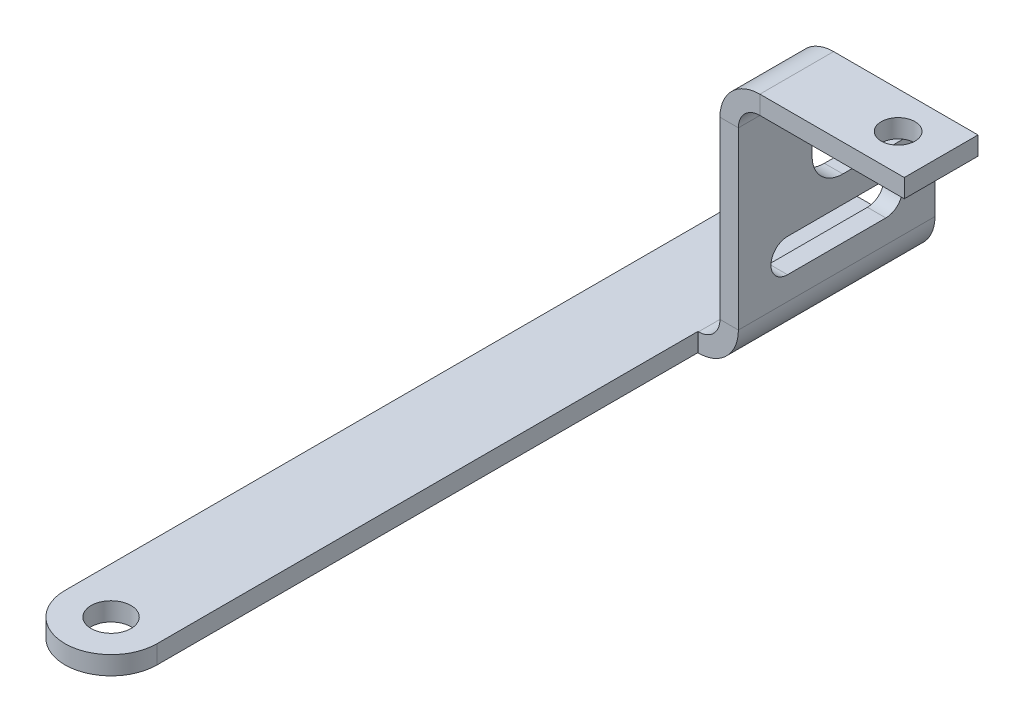
ISO-10303-21;
HEADER;
FILE_DESCRIPTION(('STEP AP214'),'2;1');
FILE_NAME('part.step','',(''),(''),'','','');
FILE_SCHEMA(('AUTOMOTIVE_DESIGN { 1 0 10303 214 1 1 1 1 }'));
ENDSEC;
DATA;
#1=APPLICATION_CONTEXT('core data for automotive mechanical design processes');
#2=APPLICATION_PROTOCOL_DEFINITION('international standard','automotive_design',2000,#1);
#3=PRODUCT_CONTEXT('',#1,'mechanical');
#4=PRODUCT('Part','Part','',(#3));
#5=PRODUCT_RELATED_PRODUCT_CATEGORY('part','',(#4));
#6=PRODUCT_DEFINITION_FORMATION('','',#4);
#7=PRODUCT_DEFINITION_CONTEXT('part definition',#1,'design');
#8=PRODUCT_DEFINITION('design','',#6,#7);
#9=PRODUCT_DEFINITION_SHAPE('','',#8);
#10=(LENGTH_UNIT() NAMED_UNIT(*) SI_UNIT(.MILLI.,.METRE.));
#11=(NAMED_UNIT(*) PLANE_ANGLE_UNIT() SI_UNIT($,.RADIAN.));
#12=(NAMED_UNIT(*) SI_UNIT($,.STERADIAN.) SOLID_ANGLE_UNIT());
#13=UNCERTAINTY_MEASURE_WITH_UNIT(LENGTH_MEASURE(1.E-05),#10,'distance_accuracy_value','');
#14=(GEOMETRIC_REPRESENTATION_CONTEXT(3) GLOBAL_UNCERTAINTY_ASSIGNED_CONTEXT((#13)) GLOBAL_UNIT_ASSIGNED_CONTEXT((#10,
#11,#12)) REPRESENTATION_CONTEXT('',''));
#15=CARTESIAN_POINT('',(0.,0.,0.));
#16=DIRECTION('',(0.,0.,1.));
#17=DIRECTION('',(1.,0.,0.));
#18=AXIS2_PLACEMENT_3D('',#15,#16,#17);
#19=CARTESIAN_POINT('',(14.1,20.,-88.));
#20=DIRECTION('',(0.,-1.,0.));
#21=DIRECTION('',(1.,0.,0.));
#22=AXIS2_PLACEMENT_3D('',#19,#20,#21);
#23=PLANE('',#22);
#24=DIRECTION('',(0.,0.,-1.));
#25=VECTOR('',#24,1.);
#26=CARTESIAN_POINT('',(11.1,20.,-88.));
#27=LINE('',#26,#25);
#28=CARTESIAN_POINT('',(11.1,20.,-115.));
#29=VERTEX_POINT('',#28);
#30=CARTESIAN_POINT('',(11.1,20.,-105.));
#31=VERTEX_POINT('',#30);
#32=EDGE_CURVE('E340',#29,#31,#27,.F.);
#33=ORIENTED_EDGE('',*,*,#32,.T.);
#34=DIRECTION('',(-1.,0.,0.));
#35=VECTOR('',#34,1.);
#36=CARTESIAN_POINT('',(14.1,20.,-105.));
#37=LINE('',#36,#35);
#38=CARTESIAN_POINT('',(14.1,20.,-105.));
#39=VERTEX_POINT('',#38);
#40=EDGE_CURVE('E425',#31,#39,#37,.F.);
#41=ORIENTED_EDGE('',*,*,#40,.T.);
#42=DIRECTION('',(0.,0.,1.));
#43=VECTOR('',#42,1.);
#44=CARTESIAN_POINT('',(14.1000000000001,20.,0.));
#45=LINE('',#44,#43);
#46=CARTESIAN_POINT('',(14.1,20.,-115.));
#47=VERTEX_POINT('',#46);
#48=EDGE_CURVE('E332',#47,#39,#45,.T.);
#49=ORIENTED_EDGE('',*,*,#48,.F.);
#50=DIRECTION('',(-1.,0.,0.));
#51=VECTOR('',#50,1.);
#52=CARTESIAN_POINT('',(14.1,20.,-115.));
#53=LINE('',#52,#51);
#54=EDGE_CURVE('E422',#47,#29,#53,.T.);
#55=ORIENTED_EDGE('',*,*,#54,.T.);
#56=EDGE_LOOP('',(#33,#41,#49,#55));
#57=FACE_BOUND('',#56,.T.);
#58=ADVANCED_FACE('F75',(#57),#23,.F.);
#59=CARTESIAN_POINT('',(7.5,3.,-88.));
#60=DIRECTION('',(0.,0.,1.));
#61=DIRECTION('',(1.,0.,0.));
#62=AXIS2_PLACEMENT_3D('',#59,#60,#61);
#63=PLANE('',#62);
#64=DIRECTION('',(0.,1.,0.));
#65=VECTOR('',#64,1.);
#66=CARTESIAN_POINT('',(7.5,3.,-88.));
#67=LINE('',#66,#65);
#68=CARTESIAN_POINT('',(7.5,0.,-88.));
#69=VERTEX_POINT('',#68);
#70=CARTESIAN_POINT('',(7.5,3.,-88.));
#71=VERTEX_POINT('',#70);
#72=EDGE_CURVE('E416',#69,#71,#67,.T.);
#73=ORIENTED_EDGE('',*,*,#72,.F.);
#74=DIRECTION('',(1.,0.,0.));
#75=VECTOR('',#74,1.);
#76=CARTESIAN_POINT('',(0.,0.,-88.));
#77=LINE('',#76,#75);
#78=CARTESIAN_POINT('',(7.59999999999999,0.,-88.));
#79=VERTEX_POINT('',#78);
#80=EDGE_CURVE('E400',#69,#79,#77,.T.);
#81=ORIENTED_EDGE('',*,*,#80,.T.);
#82=DIRECTION('',(0.,1.,0.));
#83=VECTOR('',#82,1.);
#84=CARTESIAN_POINT('',(7.59999999999999,3.,-88.));
#85=LINE('',#84,#83);
#86=CARTESIAN_POINT('',(7.59999999999999,3.,-88.));
#87=VERTEX_POINT('',#86);
#88=EDGE_CURVE('E414',#79,#87,#85,.T.);
#89=ORIENTED_EDGE('',*,*,#88,.T.);
#90=DIRECTION('',(1.,0.,0.));
#91=VECTOR('',#90,1.);
#92=CARTESIAN_POINT('',(7.5,3.,-88.));
#93=LINE('',#92,#91);
#94=EDGE_CURVE('E373',#71,#87,#93,.T.);
#95=ORIENTED_EDGE('',*,*,#94,.F.);
#96=EDGE_LOOP('',(#73,#81,#89,#95));
#97=FACE_BOUND('',#96,.T.);
#98=ADVANCED_FACE('F508',(#97),#63,.T.);
#99=CARTESIAN_POINT('',(-7.5,3.,-120.));
#100=DIRECTION('',(0.,0.,-1.));
#101=DIRECTION('',(-1.,0.,0.));
#102=AXIS2_PLACEMENT_3D('',#99,#100,#101);
#103=PLANE('',#102);
#104=DIRECTION('',(0.,1.,0.));
#105=VECTOR('',#104,1.);
#106=CARTESIAN_POINT('',(7.59999999999999,3.,-120.));
#107=LINE('',#106,#105);
#108=CARTESIAN_POINT('',(7.59999999999999,0.,-120.));
#109=VERTEX_POINT('',#108);
#110=CARTESIAN_POINT('',(7.59999999999999,3.,-120.));
#111=VERTEX_POINT('',#110);
#112=EDGE_CURVE('E411',#109,#111,#107,.T.);
#113=ORIENTED_EDGE('',*,*,#112,.F.);
#114=DIRECTION('',(1.,0.,0.));
#115=VECTOR('',#114,1.);
#116=CARTESIAN_POINT('',(0.,0.,-120.));
#117=LINE('',#116,#115);
#118=CARTESIAN_POINT('',(-7.5,0.,-120.));
#119=VERTEX_POINT('',#118);
#120=EDGE_CURVE('E394',#109,#119,#117,.F.);
#121=ORIENTED_EDGE('',*,*,#120,.T.);
#122=DIRECTION('',(0.,1.,0.));
#123=VECTOR('',#122,1.);
#124=CARTESIAN_POINT('',(-7.5,3.,-120.));
#125=LINE('',#124,#123);
#126=CARTESIAN_POINT('',(-7.5,3.,-120.));
#127=VERTEX_POINT('',#126);
#128=EDGE_CURVE('E409',#119,#127,#125,.T.);
#129=ORIENTED_EDGE('',*,*,#128,.T.);
#130=DIRECTION('',(-1.,0.,0.));
#131=VECTOR('',#130,1.);
#132=CARTESIAN_POINT('',(-7.5,3.,-120.));
#133=LINE('',#132,#131);
#134=EDGE_CURVE('E378',#111,#127,#133,.T.);
#135=ORIENTED_EDGE('',*,*,#134,.F.);
#136=EDGE_LOOP('',(#113,#121,#129,#135));
#137=FACE_BOUND('',#136,.T.);
#138=ADVANCED_FACE('F524',(#137),#103,.T.);
#139=CARTESIAN_POINT('',(-7.5,3.,0.));
#140=DIRECTION('',(-1.,0.,0.));
#141=DIRECTION('',(0.,0.,1.));
#142=AXIS2_PLACEMENT_3D('',#139,#140,#141);
#143=PLANE('',#142);
#144=ORIENTED_EDGE('',*,*,#128,.F.);
#145=DIRECTION('',(0.,0.,1.));
#146=VECTOR('',#145,1.);
#147=CARTESIAN_POINT('',(-7.5,0.,0.));
#148=LINE('',#147,#146);
#149=CARTESIAN_POINT('',(-7.5,0.,0.));
#150=VERTEX_POINT('',#149);
#151=EDGE_CURVE('E391',#119,#150,#148,.T.);
#152=ORIENTED_EDGE('',*,*,#151,.T.);
#153=DIRECTION('',(0.,1.,0.));
#154=VECTOR('',#153,1.);
#155=CARTESIAN_POINT('',(-7.5,3.,0.));
#156=LINE('',#155,#154);
#157=CARTESIAN_POINT('',(-7.5,3.,0.));
#158=VERTEX_POINT('',#157);
#159=EDGE_CURVE('E407',#150,#158,#156,.T.);
#160=ORIENTED_EDGE('',*,*,#159,.T.);
#161=DIRECTION('',(0.,0.,1.));
#162=VECTOR('',#161,1.);
#163=CARTESIAN_POINT('',(-7.5,3.,0.));
#164=LINE('',#163,#162);
#165=EDGE_CURVE('E381',#127,#158,#164,.T.);
#166=ORIENTED_EDGE('',*,*,#165,.F.);
#167=EDGE_LOOP('',(#144,#152,#160,#166));
#168=FACE_BOUND('',#167,.T.);
#169=ADVANCED_FACE('F521',(#168),#143,.T.);
#170=CARTESIAN_POINT('',(0.,3.,0.));
#171=DIRECTION('',(0.,1.,0.));
#172=DIRECTION('',(0.,0.,1.));
#173=AXIS2_PLACEMENT_3D('',#170,#171,#172);
#174=CYLINDRICAL_SURFACE('',#173,7.5);
#175=ORIENTED_EDGE('',*,*,#159,.F.);
#176=CARTESIAN_POINT('',(0.,0.,0.));
#177=DIRECTION('',(0.,1.,0.));
#178=DIRECTION('',(0.,0.,1.));
#179=AXIS2_PLACEMENT_3D('',#176,#177,#178);
#180=CIRCLE('',#179,7.5);
#181=CARTESIAN_POINT('',(7.5,0.,0.));
#182=VERTEX_POINT('',#181);
#183=EDGE_CURVE('E357',#150,#182,#180,.T.);
#184=ORIENTED_EDGE('',*,*,#183,.T.);
#185=DIRECTION('',(0.,1.,0.));
#186=VECTOR('',#185,1.);
#187=CARTESIAN_POINT('',(7.5,3.,0.));
#188=LINE('',#187,#186);
#189=CARTESIAN_POINT('',(7.5,3.,0.));
#190=VERTEX_POINT('',#189);
#191=EDGE_CURVE('E387',#182,#190,#188,.T.);
#192=ORIENTED_EDGE('',*,*,#191,.T.);
#193=CARTESIAN_POINT('',(0.,3.,0.));
#194=DIRECTION('',(0.,1.,0.));
#195=DIRECTION('',(0.,0.,1.));
#196=AXIS2_PLACEMENT_3D('',#193,#194,#195);
#197=CIRCLE('',#196,7.5);
#198=EDGE_CURVE('E366',#158,#190,#197,.T.);
#199=ORIENTED_EDGE('',*,*,#198,.F.);
#200=EDGE_LOOP('',(#175,#184,#192,#199));
#201=FACE_BOUND('',#200,.T.);
#202=ADVANCED_FACE('F519',(#201),#174,.T.);
#203=CARTESIAN_POINT('',(7.5,3.,0.));
#204=DIRECTION('',(1.,0.,0.));
#205=DIRECTION('',(0.,0.,-1.));
#206=AXIS2_PLACEMENT_3D('',#203,#204,#205);
#207=PLANE('',#206);
#208=DIRECTION('',(0.,0.,1.));
#209=VECTOR('',#208,1.);
#210=CARTESIAN_POINT('',(7.5,0.,0.));
#211=LINE('',#210,#209);
#212=EDGE_CURVE('E390',#182,#69,#211,.F.);
#213=ORIENTED_EDGE('',*,*,#212,.T.);
#214=ORIENTED_EDGE('',*,*,#72,.T.);
#215=DIRECTION('',(0.,0.,-1.));
#216=VECTOR('',#215,1.);
#217=CARTESIAN_POINT('',(7.5,3.,0.));
#218=LINE('',#217,#216);
#219=EDGE_CURVE('E369',#190,#71,#218,.T.);
#220=ORIENTED_EDGE('',*,*,#219,.F.);
#221=ORIENTED_EDGE('',*,*,#191,.F.);
#222=EDGE_LOOP('',(#213,#214,#220,#221));
#223=FACE_BOUND('',#222,.T.);
#224=ADVANCED_FACE('F512',(#223),#207,.T.);
#225=CARTESIAN_POINT('',(0.,3.,0.));
#226=DIRECTION('',(0.,1.,0.));
#227=DIRECTION('',(0.,0.,1.));
#228=AXIS2_PLACEMENT_3D('',#225,#226,#227);
#229=CYLINDRICAL_SURFACE('',#228,3.25);
#230=CARTESIAN_POINT('',(0.,3.,0.));
#231=DIRECTION('',(0.,1.,0.));
#232=DIRECTION('',(0.,0.,1.));
#233=AXIS2_PLACEMENT_3D('',#230,#231,#232);
#234=CIRCLE('',#233,3.25);
#235=CARTESIAN_POINT('',(0.,3.,3.25));
#236=VERTEX_POINT('',#235);
#237=EDGE_CURVE('E384',#236,#236,#234,.T.);
#238=ORIENTED_EDGE('',*,*,#237,.T.);
#239=EDGE_LOOP('',(#238));
#240=FACE_BOUND('',#239,.T.);
#241=CARTESIAN_POINT('',(0.,0.,0.));
#242=DIRECTION('',(0.,1.,0.));
#243=DIRECTION('',(0.,0.,1.));
#244=AXIS2_PLACEMENT_3D('',#241,#242,#243);
#245=CIRCLE('',#244,3.25);
#246=CARTESIAN_POINT('',(0.,0.,3.25));
#247=VERTEX_POINT('',#246);
#248=EDGE_CURVE('E370',#247,#247,#245,.T.);
#249=ORIENTED_EDGE('',*,*,#248,.F.);
#250=EDGE_LOOP('',(#249));
#251=FACE_BOUND('',#250,.T.);
#252=ADVANCED_FACE('F552',(#240,#251),#229,.F.);
#253=CARTESIAN_POINT('',(0.,3.,0.));
#254=DIRECTION('',(0.,1.,0.));
#255=DIRECTION('',(0.,0.,1.));
#256=AXIS2_PLACEMENT_3D('',#253,#254,#255);
#257=PLANE('',#256);
#258=ORIENTED_EDGE('',*,*,#198,.T.);
#259=ORIENTED_EDGE('',*,*,#219,.T.);
#260=ORIENTED_EDGE('',*,*,#94,.T.);
#261=DIRECTION('',(0.,0.,-1.));
#262=VECTOR('',#261,1.);
#263=CARTESIAN_POINT('',(7.59999999999999,3.,-120.));
#264=LINE('',#263,#262);
#265=EDGE_CURVE('E376',#87,#111,#264,.T.);
#266=ORIENTED_EDGE('',*,*,#265,.T.);
#267=ORIENTED_EDGE('',*,*,#134,.T.);
#268=ORIENTED_EDGE('',*,*,#165,.T.);
#269=EDGE_LOOP('',(#258,#259,#260,#266,#267,#268));
#270=FACE_BOUND('',#269,.T.);
#271=ORIENTED_EDGE('',*,*,#237,.F.);
#272=EDGE_LOOP('',(#271));
#273=FACE_BOUND('',#272,.T.);
#274=ADVANCED_FACE('F514',(#270,#273),#257,.T.);
#275=CARTESIAN_POINT('',(0.,0.,0.));
#276=DIRECTION('',(0.,1.,0.));
#277=DIRECTION('',(0.,0.,1.));
#278=AXIS2_PLACEMENT_3D('',#275,#276,#277);
#279=PLANE('',#278);
#280=ORIENTED_EDGE('',*,*,#183,.F.);
#281=ORIENTED_EDGE('',*,*,#151,.F.);
#282=ORIENTED_EDGE('',*,*,#120,.F.);
#283=DIRECTION('',(0.,0.,1.));
#284=VECTOR('',#283,1.);
#285=CARTESIAN_POINT('',(7.59999999999999,0.,0.));
#286=LINE('',#285,#284);
#287=EDGE_CURVE('E397',#79,#109,#286,.F.);
#288=ORIENTED_EDGE('',*,*,#287,.F.);
#289=ORIENTED_EDGE('',*,*,#80,.F.);
#290=ORIENTED_EDGE('',*,*,#212,.F.);
#291=EDGE_LOOP('',(#280,#281,#282,#288,#289,#290));
#292=FACE_BOUND('',#291,.T.);
#293=ORIENTED_EDGE('',*,*,#248,.T.);
#294=EDGE_LOOP('',(#293));
#295=FACE_BOUND('',#294,.T.);
#296=ADVANCED_FACE('F503',(#292,#295),#279,.F.);
#297=CARTESIAN_POINT('',(7.59999999999999,6.5,-88.));
#298=DIRECTION('',(0.,0.,1.));
#299=DIRECTION('',(1.,0.,0.));
#300=AXIS2_PLACEMENT_3D('',#297,#298,#299);
#301=PLANE('',#300);
#302=DIRECTION('',(-1.,0.,0.));
#303=VECTOR('',#302,1.);
#304=CARTESIAN_POINT('',(14.1,6.49999999999998,-88.));
#305=LINE('',#304,#303);
#306=CARTESIAN_POINT('',(11.1,6.49999999999999,-88.));
#307=VERTEX_POINT('',#306);
#308=CARTESIAN_POINT('',(14.1,6.49999999999998,-88.));
#309=VERTEX_POINT('',#308);
#310=EDGE_CURVE('E327',#307,#309,#305,.F.);
#311=ORIENTED_EDGE('',*,*,#310,.F.);
#312=CARTESIAN_POINT('',(7.59999999999999,6.5,-88.));
#313=DIRECTION('',(0.,0.,-1.));
#314=DIRECTION('',(-1.,0.,0.));
#315=AXIS2_PLACEMENT_3D('',#312,#313,#314);
#316=CIRCLE('',#315,3.5);
#317=EDGE_CURVE('E361',#87,#307,#316,.F.);
#318=ORIENTED_EDGE('',*,*,#317,.F.);
#319=ORIENTED_EDGE('',*,*,#88,.F.);
#320=CARTESIAN_POINT('',(7.59999999999999,6.5,-88.));
#321=DIRECTION('',(0.,0.,-1.));
#322=DIRECTION('',(-1.,0.,0.));
#323=AXIS2_PLACEMENT_3D('',#320,#321,#322);
#324=CIRCLE('',#323,6.5);
#325=EDGE_CURVE('E354',#79,#309,#324,.F.);
#326=ORIENTED_EDGE('',*,*,#325,.T.);
#327=EDGE_LOOP('',(#311,#318,#319,#326));
#328=FACE_BOUND('',#327,.T.);
#329=ADVANCED_FACE('F498',(#328),#301,.T.);
#330=CARTESIAN_POINT('',(7.59999999999999,6.5,-120.));
#331=DIRECTION('',(0.,0.,1.));
#332=DIRECTION('',(1.,0.,0.));
#333=AXIS2_PLACEMENT_3D('',#330,#331,#332);
#334=PLANE('',#333);
#335=CARTESIAN_POINT('',(7.59999999999999,6.5,-120.));
#336=DIRECTION('',(0.,0.,-1.));
#337=DIRECTION('',(-1.,0.,0.));
#338=AXIS2_PLACEMENT_3D('',#335,#336,#337);
#339=CIRCLE('',#338,3.5);
#340=CARTESIAN_POINT('',(11.1,6.49999999999999,-120.));
#341=VERTEX_POINT('',#340);
#342=EDGE_CURVE('E331',#341,#111,#339,.T.);
#343=ORIENTED_EDGE('',*,*,#342,.F.);
#344=DIRECTION('',(-1.,0.,0.));
#345=VECTOR('',#344,1.);
#346=CARTESIAN_POINT('',(11.1,6.49999999999999,-120.));
#347=LINE('',#346,#345);
#348=CARTESIAN_POINT('',(14.1,6.49999999999998,-120.));
#349=VERTEX_POINT('',#348);
#350=EDGE_CURVE('E347',#341,#349,#347,.F.);
#351=ORIENTED_EDGE('',*,*,#350,.T.);
#352=CARTESIAN_POINT('',(7.59999999999999,6.5,-120.));
#353=DIRECTION('',(0.,0.,-1.));
#354=DIRECTION('',(-1.,0.,0.));
#355=AXIS2_PLACEMENT_3D('',#352,#353,#354);
#356=CIRCLE('',#355,6.5);
#357=EDGE_CURVE('E358',#349,#109,#356,.T.);
#358=ORIENTED_EDGE('',*,*,#357,.T.);
#359=ORIENTED_EDGE('',*,*,#112,.T.);
#360=EDGE_LOOP('',(#343,#351,#358,#359));
#361=FACE_BOUND('',#360,.T.);
#362=ADVANCED_FACE('F490',(#361),#334,.F.);
#363=CARTESIAN_POINT('',(7.59999999999999,6.5,-120.));
#364=DIRECTION('',(0.,0.,-1.));
#365=DIRECTION('',(1.,0.,0.));
#366=AXIS2_PLACEMENT_3D('',#363,#364,#365);
#367=CYLINDRICAL_SURFACE('',#366,6.5);
#368=ORIENTED_EDGE('',*,*,#287,.T.);
#369=ORIENTED_EDGE('',*,*,#357,.F.);
#370=DIRECTION('',(0.,0.,-1.));
#371=VECTOR('',#370,1.);
#372=CARTESIAN_POINT('',(14.1,6.49999999999998,-88.));
#373=LINE('',#372,#371);
#374=EDGE_CURVE('E345',#349,#309,#373,.F.);
#375=ORIENTED_EDGE('',*,*,#374,.T.);
#376=ORIENTED_EDGE('',*,*,#325,.F.);
#377=EDGE_LOOP('',(#368,#369,#375,#376));
#378=FACE_BOUND('',#377,.T.);
#379=ADVANCED_FACE('F499',(#378),#367,.T.);
#380=CARTESIAN_POINT('',(7.59999999999999,6.5,-120.));
#381=DIRECTION('',(0.,0.,-1.));
#382=DIRECTION('',(1.,0.,0.));
#383=AXIS2_PLACEMENT_3D('',#380,#381,#382);
#384=CYLINDRICAL_SURFACE('',#383,3.5);
#385=ORIENTED_EDGE('',*,*,#265,.F.);
#386=ORIENTED_EDGE('',*,*,#317,.T.);
#387=DIRECTION('',(0.,0.,-1.));
#388=VECTOR('',#387,1.);
#389=CARTESIAN_POINT('',(11.1,6.49999999999999,-88.));
#390=LINE('',#389,#388);
#391=EDGE_CURVE('E350',#307,#341,#390,.T.);
#392=ORIENTED_EDGE('',*,*,#391,.T.);
#393=ORIENTED_EDGE('',*,*,#342,.T.);
#394=EDGE_LOOP('',(#385,#386,#392,#393));
#395=FACE_BOUND('',#394,.T.);
#396=ADVANCED_FACE('F494',(#395),#384,.F.);
#397=CARTESIAN_POINT('',(14.1,20.,-120.));
#398=DIRECTION('',(0.,0.,1.));
#399=DIRECTION('',(1.,0.,0.));
#400=AXIS2_PLACEMENT_3D('',#397,#398,#399);
#401=PLANE('',#400);
#402=DIRECTION('',(0.,-1.,0.));
#403=VECTOR('',#402,1.);
#404=CARTESIAN_POINT('',(11.1,20.,-120.));
#405=LINE('',#404,#403);
#406=CARTESIAN_POINT('',(11.1,15.,-120.));
#407=VERTEX_POINT('',#406);
#408=EDGE_CURVE('E343',#341,#407,#405,.F.);
#409=ORIENTED_EDGE('',*,*,#408,.T.);
#410=DIRECTION('',(-1.,0.,0.));
#411=VECTOR('',#410,1.);
#412=CARTESIAN_POINT('',(14.1,15.,-120.));
#413=LINE('',#412,#411);
#414=CARTESIAN_POINT('',(14.1,15.,-120.));
#415=VERTEX_POINT('',#414);
#416=EDGE_CURVE('E90',#407,#415,#413,.F.);
#417=ORIENTED_EDGE('',*,*,#416,.T.);
#418=DIRECTION('',(0.,1.,0.));
#419=VECTOR('',#418,1.);
#420=CARTESIAN_POINT('',(14.1,0.,-120.));
#421=LINE('',#420,#419);
#422=EDGE_CURVE('E335',#349,#415,#421,.T.);
#423=ORIENTED_EDGE('',*,*,#422,.F.);
#424=ORIENTED_EDGE('',*,*,#350,.F.);
#425=EDGE_LOOP('',(#409,#417,#423,#424));
#426=FACE_BOUND('',#425,.T.);
#427=ADVANCED_FACE('F487',(#426),#401,.F.);
#428=CARTESIAN_POINT('',(14.1,2.99999999999999,-88.));
#429=DIRECTION('',(0.,0.,-1.));
#430=DIRECTION('',(-1.,0.,0.));
#431=AXIS2_PLACEMENT_3D('',#428,#429,#430);
#432=PLANE('',#431);
#433=ORIENTED_EDGE('',*,*,#310,.T.);
#434=DIRECTION('',(0.,-1.,0.));
#435=VECTOR('',#434,1.);
#436=CARTESIAN_POINT('',(14.1,0.,-88.));
#437=LINE('',#436,#435);
#438=CARTESIAN_POINT('',(14.1000000000001,34.9999999999999,-88.));
#439=VERTEX_POINT('',#438);
#440=EDGE_CURVE('E328',#439,#309,#437,.T.);
#441=ORIENTED_EDGE('',*,*,#440,.F.);
#442=DIRECTION('',(-1.,0.,0.));
#443=VECTOR('',#442,1.);
#444=CARTESIAN_POINT('',(33.3093727122986,34.9999999999999,-88.));
#445=LINE('',#444,#443);
#446=CARTESIAN_POINT('',(11.1000000000001,34.9999999999999,-88.));
#447=VERTEX_POINT('',#446);
#448=EDGE_CURVE('E320',#439,#447,#445,.T.);
#449=ORIENTED_EDGE('',*,*,#448,.T.);
#450=DIRECTION('',(0.,1.,0.));
#451=VECTOR('',#450,1.);
#452=CARTESIAN_POINT('',(11.1,3.,-88.));
#453=LINE('',#452,#451);
#454=EDGE_CURVE('E337',#447,#307,#453,.F.);
#455=ORIENTED_EDGE('',*,*,#454,.T.);
#456=EDGE_LOOP('',(#433,#441,#449,#455));
#457=FACE_BOUND('',#456,.T.);
#458=ADVANCED_FACE('F481',(#457),#432,.F.);
#459=CARTESIAN_POINT('',(14.1,0.,0.));
#460=DIRECTION('',(-1.,0.,0.));
#461=DIRECTION('',(0.,-1.,0.));
#462=AXIS2_PLACEMENT_3D('',#459,#460,#461);
#463=PLANE('',#462);
#464=DIRECTION('',(0.,0.,-1.));
#465=VECTOR('',#464,1.);
#466=CARTESIAN_POINT('',(14.1,15.6999999999999,0.));
#467=LINE('',#466,#465);
#468=CARTESIAN_POINT('',(14.1,15.6999999999999,-96.));
#469=VERTEX_POINT('',#468);
#470=CARTESIAN_POINT('',(14.1,15.6999999999999,-112.));
#471=VERTEX_POINT('',#470);
#472=EDGE_CURVE('E262',#469,#471,#467,.T.);
#473=ORIENTED_EDGE('',*,*,#472,.T.);
#474=CARTESIAN_POINT('',(14.1,12.9999999999999,-112.));
#475=DIRECTION('',(-1.,0.,0.));
#476=DIRECTION('',(0.,-1.,0.));
#477=AXIS2_PLACEMENT_3D('',#474,#475,#476);
#478=CIRCLE('',#477,2.7);
#479=CARTESIAN_POINT('',(14.1,10.2999999999999,-112.));
#480=VERTEX_POINT('',#479);
#481=EDGE_CURVE('E265',#471,#480,#478,.T.);
#482=ORIENTED_EDGE('',*,*,#481,.T.);
#483=DIRECTION('',(0.,0.,1.));
#484=VECTOR('',#483,1.);
#485=CARTESIAN_POINT('',(14.1,10.2999999999999,0.));
#486=LINE('',#485,#484);
#487=CARTESIAN_POINT('',(14.1,10.2999999999999,-96.));
#488=VERTEX_POINT('',#487);
#489=EDGE_CURVE('E257',#480,#488,#486,.T.);
#490=ORIENTED_EDGE('',*,*,#489,.T.);
#491=CARTESIAN_POINT('',(14.1,12.9999999999999,-96.));
#492=DIRECTION('',(-1.,0.,0.));
#493=DIRECTION('',(0.,-1.,0.));
#494=AXIS2_PLACEMENT_3D('',#491,#492,#493);
#495=CIRCLE('',#494,2.7);
#496=EDGE_CURVE('E233',#488,#469,#495,.T.);
#497=ORIENTED_EDGE('',*,*,#496,.T.);
#498=EDGE_LOOP('',(#473,#482,#490,#497));
#499=FACE_BOUND('',#498,.T.);
#500=ORIENTED_EDGE('',*,*,#422,.T.);
#501=CARTESIAN_POINT('',(14.1,15.,-115.));
#502=DIRECTION('',(-1.,0.,0.));
#503=DIRECTION('',(0.,-1.,0.));
#504=AXIS2_PLACEMENT_3D('',#501,#502,#503);
#505=CIRCLE('',#504,5.);
#506=EDGE_CURVE('E429',#415,#47,#505,.F.);
#507=ORIENTED_EDGE('',*,*,#506,.T.);
#508=ORIENTED_EDGE('',*,*,#48,.T.);
#509=CARTESIAN_POINT('',(14.1000000000001,25.,-105.));
#510=DIRECTION('',(-1.,0.,0.));
#511=DIRECTION('',(0.,-1.,0.));
#512=AXIS2_PLACEMENT_3D('',#509,#510,#511);
#513=CIRCLE('',#512,5.);
#514=CARTESIAN_POINT('',(14.1000000000001,25.,-100.));
#515=VERTEX_POINT('',#514);
#516=EDGE_CURVE('E13',#39,#515,#513,.T.);
#517=ORIENTED_EDGE('',*,*,#516,.T.);
#518=DIRECTION('',(0.,1.,0.));
#519=VECTOR('',#518,1.);
#520=CARTESIAN_POINT('',(14.1,20.,-100.));
#521=LINE('',#520,#519);
#522=CARTESIAN_POINT('',(14.1000000000001,34.9999999999999,-100.));
#523=VERTEX_POINT('',#522);
#524=EDGE_CURVE('E311',#515,#523,#521,.T.);
#525=ORIENTED_EDGE('',*,*,#524,.T.);
#526=DIRECTION('',(0.,0.,1.));
#527=VECTOR('',#526,1.);
#528=CARTESIAN_POINT('',(14.1000000000001,34.9999999999999,-88.));
#529=LINE('',#528,#527);
#530=EDGE_CURVE('E313',#523,#439,#529,.T.);
#531=ORIENTED_EDGE('',*,*,#530,.T.);
#532=ORIENTED_EDGE('',*,*,#440,.T.);
#533=ORIENTED_EDGE('',*,*,#374,.F.);
#534=EDGE_LOOP('',(#500,#507,#508,#517,#525,#531,#532,#533));
#535=FACE_BOUND('',#534,.T.);
#536=ADVANCED_FACE('F441',(#499,#535),#463,.F.);
#537=CARTESIAN_POINT('',(11.1,0.,0.));
#538=DIRECTION('',(-1.,0.,0.));
#539=DIRECTION('',(0.,-1.,0.));
#540=AXIS2_PLACEMENT_3D('',#537,#538,#539);
#541=PLANE('',#540);
#542=CARTESIAN_POINT('',(11.1,12.9999999999999,-112.));
#543=DIRECTION('',(-1.,0.,0.));
#544=DIRECTION('',(0.,-1.,0.));
#545=AXIS2_PLACEMENT_3D('',#542,#543,#544);
#546=CIRCLE('',#545,2.7);
#547=CARTESIAN_POINT('',(11.1,15.6999999999999,-112.));
#548=VERTEX_POINT('',#547);
#549=CARTESIAN_POINT('',(11.1,10.2999999999999,-112.));
#550=VERTEX_POINT('',#549);
#551=EDGE_CURVE('E246',#548,#550,#546,.T.);
#552=ORIENTED_EDGE('',*,*,#551,.F.);
#553=DIRECTION('',(0.,0.,-1.));
#554=VECTOR('',#553,1.);
#555=CARTESIAN_POINT('',(11.1,15.6999999999999,-112.));
#556=LINE('',#555,#554);
#557=CARTESIAN_POINT('',(11.1,15.6999999999999,-96.));
#558=VERTEX_POINT('',#557);
#559=EDGE_CURVE('E250',#558,#548,#556,.T.);
#560=ORIENTED_EDGE('',*,*,#559,.F.);
#561=CARTESIAN_POINT('',(11.1,12.9999999999999,-96.));
#562=DIRECTION('',(-1.,0.,0.));
#563=DIRECTION('',(0.,-1.,0.));
#564=AXIS2_PLACEMENT_3D('',#561,#562,#563);
#565=CIRCLE('',#564,2.7);
#566=CARTESIAN_POINT('',(11.1,10.2999999999999,-96.));
#567=VERTEX_POINT('',#566);
#568=EDGE_CURVE('E230',#567,#558,#565,.T.);
#569=ORIENTED_EDGE('',*,*,#568,.F.);
#570=DIRECTION('',(0.,0.,1.));
#571=VECTOR('',#570,1.);
#572=CARTESIAN_POINT('',(11.1,10.2999999999999,-112.));
#573=LINE('',#572,#571);
#574=EDGE_CURVE('E241',#550,#567,#573,.T.);
#575=ORIENTED_EDGE('',*,*,#574,.F.);
#576=EDGE_LOOP('',(#552,#560,#569,#575));
#577=FACE_BOUND('',#576,.T.);
#578=ORIENTED_EDGE('',*,*,#32,.F.);
#579=CARTESIAN_POINT('',(11.1,15.,-115.));
#580=DIRECTION('',(-1.,0.,0.));
#581=DIRECTION('',(0.,-1.,0.));
#582=AXIS2_PLACEMENT_3D('',#579,#580,#581);
#583=CIRCLE('',#582,5.);
#584=EDGE_CURVE('E98',#29,#407,#583,.T.);
#585=ORIENTED_EDGE('',*,*,#584,.T.);
#586=ORIENTED_EDGE('',*,*,#408,.F.);
#587=ORIENTED_EDGE('',*,*,#391,.F.);
#588=ORIENTED_EDGE('',*,*,#454,.F.);
#589=DIRECTION('',(0.,0.,-1.));
#590=VECTOR('',#589,1.);
#591=CARTESIAN_POINT('',(11.1000000000001,34.9999999999999,-88.));
#592=LINE('',#591,#590);
#593=CARTESIAN_POINT('',(11.1000000000001,34.9999999999999,-100.));
#594=VERTEX_POINT('',#593);
#595=EDGE_CURVE('E302',#447,#594,#592,.T.);
#596=ORIENTED_EDGE('',*,*,#595,.T.);
#597=DIRECTION('',(0.,-1.,0.));
#598=VECTOR('',#597,1.);
#599=CARTESIAN_POINT('',(11.1,20.,-100.));
#600=LINE('',#599,#598);
#601=CARTESIAN_POINT('',(11.1000000000001,25.,-100.));
#602=VERTEX_POINT('',#601);
#603=EDGE_CURVE('E317',#594,#602,#600,.T.);
#604=ORIENTED_EDGE('',*,*,#603,.T.);
#605=CARTESIAN_POINT('',(11.1000000000001,25.,-105.));
#606=DIRECTION('',(-1.,0.,0.));
#607=DIRECTION('',(0.,-1.,0.));
#608=AXIS2_PLACEMENT_3D('',#605,#606,#607);
#609=CIRCLE('',#608,5.);
#610=EDGE_CURVE('E83',#602,#31,#609,.F.);
#611=ORIENTED_EDGE('',*,*,#610,.T.);
#612=EDGE_LOOP('',(#578,#585,#586,#587,#588,#596,#604,#611));
#613=FACE_BOUND('',#612,.T.);
#614=ADVANCED_FACE('F248',(#577,#613),#541,.T.);
#615=CARTESIAN_POINT('',(33.3093727122985,19.9999999999999,-100.));
#616=DIRECTION('',(0.,0.,-1.));
#617=DIRECTION('',(-1.,0.,0.));
#618=AXIS2_PLACEMENT_3D('',#615,#616,#617);
#619=PLANE('',#618);
#620=ORIENTED_EDGE('',*,*,#524,.F.);
#621=DIRECTION('',(-1.,0.,0.));
#622=VECTOR('',#621,1.);
#623=CARTESIAN_POINT('',(33.3093727122985,24.9999999999999,-100.));
#624=LINE('',#623,#622);
#625=EDGE_CURVE('E418',#515,#602,#624,.T.);
#626=ORIENTED_EDGE('',*,*,#625,.T.);
#627=ORIENTED_EDGE('',*,*,#603,.F.);
#628=DIRECTION('',(-1.,0.,0.));
#629=VECTOR('',#628,1.);
#630=CARTESIAN_POINT('',(33.3093727122986,34.9999999999999,-100.));
#631=LINE('',#630,#629);
#632=EDGE_CURVE('E314',#523,#594,#631,.T.);
#633=ORIENTED_EDGE('',*,*,#632,.F.);
#634=EDGE_LOOP('',(#620,#626,#627,#633));
#635=FACE_BOUND('',#634,.T.);
#636=ADVANCED_FACE('F445',(#635),#619,.T.);
#637=CARTESIAN_POINT('',(17.6000000000001,34.9999999999999,-100.));
#638=DIRECTION('',(0.,0.,-1.));
#639=DIRECTION('',(-1.,0.,0.));
#640=AXIS2_PLACEMENT_3D('',#637,#638,#639);
#641=PLANE('',#640);
#642=DIRECTION('',(0.,-1.,0.));
#643=VECTOR('',#642,1.);
#644=CARTESIAN_POINT('',(17.6000000000001,41.4999999999999,-100.));
#645=LINE('',#644,#643);
#646=CARTESIAN_POINT('',(17.6000000000001,38.4999999999999,-100.));
#647=VERTEX_POINT('',#646);
#648=CARTESIAN_POINT('',(17.6000000000001,41.4999999999999,-100.));
#649=VERTEX_POINT('',#648);
#650=EDGE_CURVE('E268',#647,#649,#645,.F.);
#651=ORIENTED_EDGE('',*,*,#650,.F.);
#652=CARTESIAN_POINT('',(17.6000000000001,34.9999999999999,-100.));
#653=DIRECTION('',(0.,0.,1.));
#654=DIRECTION('',(1.,0.,0.));
#655=AXIS2_PLACEMENT_3D('',#652,#653,#654);
#656=CIRCLE('',#655,3.5);
#657=EDGE_CURVE('E306',#523,#647,#656,.F.);
#658=ORIENTED_EDGE('',*,*,#657,.F.);
#659=ORIENTED_EDGE('',*,*,#632,.T.);
#660=CARTESIAN_POINT('',(17.6000000000001,34.9999999999999,-100.));
#661=DIRECTION('',(0.,0.,1.));
#662=DIRECTION('',(1.,0.,0.));
#663=AXIS2_PLACEMENT_3D('',#660,#661,#662);
#664=CIRCLE('',#663,6.5);
#665=EDGE_CURVE('E299',#594,#649,#664,.F.);
#666=ORIENTED_EDGE('',*,*,#665,.T.);
#667=EDGE_LOOP('',(#651,#658,#659,#666));
#668=FACE_BOUND('',#667,.T.);
#669=ADVANCED_FACE('F448',(#668),#641,.T.);
#670=CARTESIAN_POINT('',(17.6000000000001,34.9999999999999,-88.));
#671=DIRECTION('',(0.,0.,-1.));
#672=DIRECTION('',(-1.,0.,0.));
#673=AXIS2_PLACEMENT_3D('',#670,#671,#672);
#674=PLANE('',#673);
#675=CARTESIAN_POINT('',(17.6000000000001,34.9999999999999,-88.));
#676=DIRECTION('',(0.,0.,1.));
#677=DIRECTION('',(1.,0.,0.));
#678=AXIS2_PLACEMENT_3D('',#675,#676,#677);
#679=CIRCLE('',#678,3.5);
#680=CARTESIAN_POINT('',(17.6000000000001,38.4999999999999,-88.));
#681=VERTEX_POINT('',#680);
#682=EDGE_CURVE('E272',#681,#439,#679,.T.);
#683=ORIENTED_EDGE('',*,*,#682,.F.);
#684=DIRECTION('',(0.,-1.,0.));
#685=VECTOR('',#684,1.);
#686=CARTESIAN_POINT('',(17.6000000000001,38.4999999999999,-88.));
#687=LINE('',#686,#685);
#688=CARTESIAN_POINT('',(17.6000000000001,41.4999999999999,-88.));
#689=VERTEX_POINT('',#688);
#690=EDGE_CURVE('E292',#681,#689,#687,.F.);
#691=ORIENTED_EDGE('',*,*,#690,.T.);
#692=CARTESIAN_POINT('',(17.6000000000001,34.9999999999999,-88.));
#693=DIRECTION('',(0.,0.,1.));
#694=DIRECTION('',(1.,0.,0.));
#695=AXIS2_PLACEMENT_3D('',#692,#693,#694);
#696=CIRCLE('',#695,6.5);
#697=EDGE_CURVE('E303',#689,#447,#696,.T.);
#698=ORIENTED_EDGE('',*,*,#697,.T.);
#699=ORIENTED_EDGE('',*,*,#448,.F.);
#700=EDGE_LOOP('',(#683,#691,#698,#699));
#701=FACE_BOUND('',#700,.T.);
#702=ADVANCED_FACE('F472',(#701),#674,.F.);
#703=CARTESIAN_POINT('',(17.6000000000001,34.9999999999999,-88.));
#704=DIRECTION('',(0.,0.,1.));
#705=DIRECTION('',(0.,1.,0.));
#706=AXIS2_PLACEMENT_3D('',#703,#704,#705);
#707=CYLINDRICAL_SURFACE('',#706,6.5);
#708=ORIENTED_EDGE('',*,*,#595,.F.);
#709=ORIENTED_EDGE('',*,*,#697,.F.);
#710=DIRECTION('',(0.,0.,1.));
#711=VECTOR('',#710,1.);
#712=CARTESIAN_POINT('',(17.6000000000001,41.4999999999999,-100.));
#713=LINE('',#712,#711);
#714=EDGE_CURVE('E290',#689,#649,#713,.F.);
#715=ORIENTED_EDGE('',*,*,#714,.T.);
#716=ORIENTED_EDGE('',*,*,#665,.F.);
#717=EDGE_LOOP('',(#708,#709,#715,#716));
#718=FACE_BOUND('',#717,.T.);
#719=ADVANCED_FACE('F477',(#718),#707,.T.);
#720=CARTESIAN_POINT('',(17.6000000000001,34.9999999999999,-88.));
#721=DIRECTION('',(0.,0.,1.));
#722=DIRECTION('',(0.,1.,0.));
#723=AXIS2_PLACEMENT_3D('',#720,#721,#722);
#724=CYLINDRICAL_SURFACE('',#723,3.5);
#725=ORIENTED_EDGE('',*,*,#530,.F.);
#726=ORIENTED_EDGE('',*,*,#657,.T.);
#727=DIRECTION('',(0.,0.,1.));
#728=VECTOR('',#727,1.);
#729=CARTESIAN_POINT('',(17.6000000000001,38.4999999999999,-100.));
#730=LINE('',#729,#728);
#731=EDGE_CURVE('E295',#647,#681,#730,.T.);
#732=ORIENTED_EDGE('',*,*,#731,.T.);
#733=ORIENTED_EDGE('',*,*,#682,.T.);
#734=EDGE_LOOP('',(#725,#726,#732,#733));
#735=FACE_BOUND('',#734,.T.);
#736=ADVANCED_FACE('F451',(#735),#724,.F.);
#737=CARTESIAN_POINT('',(14.1000000000001,41.4999999999999,-100.));
#738=DIRECTION('',(0.,0.,1.));
#739=DIRECTION('',(1.,0.,0.));
#740=AXIS2_PLACEMENT_3D('',#737,#738,#739);
#741=PLANE('',#740);
#742=ORIENTED_EDGE('',*,*,#650,.T.);
#743=DIRECTION('',(-1.,0.,0.));
#744=VECTOR('',#743,1.);
#745=CARTESIAN_POINT('',(0.,41.4999999999999,-100.));
#746=LINE('',#745,#744);
#747=CARTESIAN_POINT('',(41.1000000000001,41.4999999999999,-100.));
#748=VERTEX_POINT('',#747);
#749=EDGE_CURVE('E280',#748,#649,#746,.T.);
#750=ORIENTED_EDGE('',*,*,#749,.F.);
#751=DIRECTION('',(0.,-1.,0.));
#752=VECTOR('',#751,1.);
#753=CARTESIAN_POINT('',(41.1000000000001,41.4999999999999,-100.));
#754=LINE('',#753,#752);
#755=CARTESIAN_POINT('',(41.1000000000001,38.4999999999999,-100.));
#756=VERTEX_POINT('',#755);
#757=EDGE_CURVE('E273',#748,#756,#754,.T.);
#758=ORIENTED_EDGE('',*,*,#757,.T.);
#759=DIRECTION('',(1.,0.,0.));
#760=VECTOR('',#759,1.);
#761=CARTESIAN_POINT('',(14.1000000000001,38.4999999999999,-100.));
#762=LINE('',#761,#760);
#763=EDGE_CURVE('E287',#756,#647,#762,.F.);
#764=ORIENTED_EDGE('',*,*,#763,.T.);
#765=EDGE_LOOP('',(#742,#750,#758,#764));
#766=FACE_BOUND('',#765,.T.);
#767=ADVANCED_FACE('F459',(#766),#741,.F.);
#768=CARTESIAN_POINT('',(41.1000000000001,41.4999999999999,-88.));
#769=DIRECTION('',(0.,0.,-1.));
#770=DIRECTION('',(-1.,0.,0.));
#771=AXIS2_PLACEMENT_3D('',#768,#769,#770);
#772=PLANE('',#771);
#773=ORIENTED_EDGE('',*,*,#690,.F.);
#774=DIRECTION('',(-1.,0.,0.));
#775=VECTOR('',#774,1.);
#776=CARTESIAN_POINT('',(41.1000000000001,38.4999999999999,-88.));
#777=LINE('',#776,#775);
#778=CARTESIAN_POINT('',(41.1000000000001,38.4999999999999,-88.));
#779=VERTEX_POINT('',#778);
#780=EDGE_CURVE('E285',#681,#779,#777,.F.);
#781=ORIENTED_EDGE('',*,*,#780,.T.);
#782=DIRECTION('',(0.,-1.,0.));
#783=VECTOR('',#782,1.);
#784=CARTESIAN_POINT('',(41.1000000000001,41.4999999999999,-88.));
#785=LINE('',#784,#783);
#786=CARTESIAN_POINT('',(41.1000000000001,41.4999999999999,-88.));
#787=VERTEX_POINT('',#786);
#788=EDGE_CURVE('E269',#787,#779,#785,.T.);
#789=ORIENTED_EDGE('',*,*,#788,.F.);
#790=DIRECTION('',(1.,0.,0.));
#791=VECTOR('',#790,1.);
#792=CARTESIAN_POINT('',(0.,41.4999999999999,-88.));
#793=LINE('',#792,#791);
#794=EDGE_CURVE('E278',#689,#787,#793,.T.);
#795=ORIENTED_EDGE('',*,*,#794,.F.);
#796=EDGE_LOOP('',(#773,#781,#789,#795));
#797=FACE_BOUND('',#796,.T.);
#798=ADVANCED_FACE('F469',(#797),#772,.F.);
#799=CARTESIAN_POINT('',(0.,41.4999999999999,0.));
#800=DIRECTION('',(0.,-1.,0.));
#801=DIRECTION('',(0.,0.,-1.));
#802=AXIS2_PLACEMENT_3D('',#799,#800,#801);
#803=PLANE('',#802);
#804=CARTESIAN_POINT('',(34.1000000000001,41.4999999999999,-94.));
#805=DIRECTION('',(0.,1.,0.));
#806=DIRECTION('',(0.,0.,1.));
#807=AXIS2_PLACEMENT_3D('',#804,#805,#806);
#808=CIRCLE('',#807,2.75);
#809=CARTESIAN_POINT('',(34.1000000000001,41.4999999999999,-91.25));
#810=VERTEX_POINT('',#809);
#811=EDGE_CURVE('E897',#810,#810,#808,.T.);
#812=ORIENTED_EDGE('',*,*,#811,.F.);
#813=EDGE_LOOP('',(#812));
#814=FACE_BOUND('',#813,.T.);
#815=ORIENTED_EDGE('',*,*,#714,.F.);
#816=ORIENTED_EDGE('',*,*,#794,.T.);
#817=DIRECTION('',(0.,0.,-1.));
#818=VECTOR('',#817,1.);
#819=CARTESIAN_POINT('',(41.1000000000001,41.4999999999999,0.));
#820=LINE('',#819,#818);
#821=EDGE_CURVE('E276',#787,#748,#820,.T.);
#822=ORIENTED_EDGE('',*,*,#821,.T.);
#823=ORIENTED_EDGE('',*,*,#749,.T.);
#824=EDGE_LOOP('',(#815,#816,#822,#823));
#825=FACE_BOUND('',#824,.T.);
#826=ADVANCED_FACE('F475',(#814,#825),#803,.F.);
#827=CARTESIAN_POINT('',(0.,38.4999999999999,0.));
#828=DIRECTION('',(0.,-1.,0.));
#829=DIRECTION('',(0.,0.,-1.));
#830=AXIS2_PLACEMENT_3D('',#827,#828,#829);
#831=PLANE('',#830);
#832=CARTESIAN_POINT('',(34.1000000000001,38.4999999999999,-94.));
#833=DIRECTION('',(0.,-1.,0.));
#834=DIRECTION('',(0.,0.,-1.));
#835=AXIS2_PLACEMENT_3D('',#832,#833,#834);
#836=CIRCLE('',#835,2.75);
#837=CARTESIAN_POINT('',(34.1000000000001,38.4999999999999,-96.75));
#838=VERTEX_POINT('',#837);
#839=EDGE_CURVE('E900',#838,#838,#836,.T.);
#840=ORIENTED_EDGE('',*,*,#839,.F.);
#841=EDGE_LOOP('',(#840));
#842=FACE_BOUND('',#841,.T.);
#843=ORIENTED_EDGE('',*,*,#780,.F.);
#844=ORIENTED_EDGE('',*,*,#731,.F.);
#845=ORIENTED_EDGE('',*,*,#763,.F.);
#846=DIRECTION('',(0.,0.,1.));
#847=VECTOR('',#846,1.);
#848=CARTESIAN_POINT('',(41.1000000000001,38.4999999999999,-100.));
#849=LINE('',#848,#847);
#850=EDGE_CURVE('E283',#779,#756,#849,.F.);
#851=ORIENTED_EDGE('',*,*,#850,.F.);
#852=EDGE_LOOP('',(#843,#844,#845,#851));
#853=FACE_BOUND('',#852,.T.);
#854=ADVANCED_FACE('F456',(#842,#853),#831,.T.);
#855=CARTESIAN_POINT('',(41.1000000000001,41.4999999999999,-100.));
#856=DIRECTION('',(-1.,0.,0.));
#857=DIRECTION('',(0.,0.,1.));
#858=AXIS2_PLACEMENT_3D('',#855,#856,#857);
#859=PLANE('',#858);
#860=ORIENTED_EDGE('',*,*,#850,.T.);
#861=ORIENTED_EDGE('',*,*,#757,.F.);
#862=ORIENTED_EDGE('',*,*,#821,.F.);
#863=ORIENTED_EDGE('',*,*,#788,.T.);
#864=EDGE_LOOP('',(#860,#861,#862,#863));
#865=FACE_BOUND('',#864,.T.);
#866=ADVANCED_FACE('F464',(#865),#859,.F.);
#867=CARTESIAN_POINT('',(41.1000000000002,12.9999999999998,-112.));
#868=DIRECTION('',(-1.,0.,0.));
#869=DIRECTION('',(0.,-1.,0.));
#870=AXIS2_PLACEMENT_3D('',#867,#868,#869);
#871=CYLINDRICAL_SURFACE('',#870,2.7);
#872=DIRECTION('',(-1.,0.,0.));
#873=VECTOR('',#872,1.);
#874=CARTESIAN_POINT('',(41.1000000000002,15.6999999999998,-112.));
#875=LINE('',#874,#873);
#876=EDGE_CURVE('E255',#471,#548,#875,.T.);
#877=ORIENTED_EDGE('',*,*,#876,.T.);
#878=ORIENTED_EDGE('',*,*,#551,.T.);
#879=DIRECTION('',(-1.,0.,0.));
#880=VECTOR('',#879,1.);
#881=CARTESIAN_POINT('',(41.1000000000002,10.2999999999998,-112.));
#882=LINE('',#881,#880);
#883=EDGE_CURVE('E237',#480,#550,#882,.T.);
#884=ORIENTED_EDGE('',*,*,#883,.F.);
#885=ORIENTED_EDGE('',*,*,#481,.F.);
#886=EDGE_LOOP('',(#877,#878,#884,#885));
#887=FACE_BOUND('',#886,.T.);
#888=ADVANCED_FACE('F580',(#887),#871,.F.);
#889=CARTESIAN_POINT('',(41.1000000000002,15.6999999999998,-112.));
#890=DIRECTION('',(0.,1.,0.));
#891=DIRECTION('',(-1.,0.,0.));
#892=AXIS2_PLACEMENT_3D('',#889,#890,#891);
#893=PLANE('',#892);
#894=DIRECTION('',(-1.,0.,0.));
#895=VECTOR('',#894,1.);
#896=CARTESIAN_POINT('',(41.1000000000002,15.6999999999998,-96.));
#897=LINE('',#896,#895);
#898=EDGE_CURVE('E236',#469,#558,#897,.T.);
#899=ORIENTED_EDGE('',*,*,#898,.T.);
#900=ORIENTED_EDGE('',*,*,#559,.T.);
#901=ORIENTED_EDGE('',*,*,#876,.F.);
#902=ORIENTED_EDGE('',*,*,#472,.F.);
#903=EDGE_LOOP('',(#899,#900,#901,#902));
#904=FACE_BOUND('',#903,.T.);
#905=ADVANCED_FACE('F576',(#904),#893,.F.);
#906=CARTESIAN_POINT('',(41.1000000000002,12.9999999999998,-96.));
#907=DIRECTION('',(-1.,0.,0.));
#908=DIRECTION('',(0.,-1.,0.));
#909=AXIS2_PLACEMENT_3D('',#906,#907,#908);
#910=CYLINDRICAL_SURFACE('',#909,2.7);
#911=DIRECTION('',(-1.,0.,0.));
#912=VECTOR('',#911,1.);
#913=CARTESIAN_POINT('',(41.1000000000002,10.2999999999998,-96.));
#914=LINE('',#913,#912);
#915=EDGE_CURVE('E225',#488,#567,#914,.T.);
#916=ORIENTED_EDGE('',*,*,#915,.T.);
#917=ORIENTED_EDGE('',*,*,#568,.T.);
#918=ORIENTED_EDGE('',*,*,#898,.F.);
#919=ORIENTED_EDGE('',*,*,#496,.F.);
#920=EDGE_LOOP('',(#916,#917,#918,#919));
#921=FACE_BOUND('',#920,.T.);
#922=ADVANCED_FACE('F227',(#921),#910,.F.);
#923=CARTESIAN_POINT('',(41.1000000000002,10.2999999999998,-112.));
#924=DIRECTION('',(0.,-1.,0.));
#925=DIRECTION('',(1.,0.,0.));
#926=AXIS2_PLACEMENT_3D('',#923,#924,#925);
#927=PLANE('',#926);
#928=ORIENTED_EDGE('',*,*,#883,.T.);
#929=ORIENTED_EDGE('',*,*,#574,.T.);
#930=ORIENTED_EDGE('',*,*,#915,.F.);
#931=ORIENTED_EDGE('',*,*,#489,.F.);
#932=EDGE_LOOP('',(#928,#929,#930,#931));
#933=FACE_BOUND('',#932,.T.);
#934=ADVANCED_FACE('F242',(#933),#927,.F.);
#935=CARTESIAN_POINT('',(33.3093727122985,24.9999999999999,-105.));
#936=DIRECTION('',(-1.,0.,0.));
#937=DIRECTION('',(0.,-1.,0.));
#938=AXIS2_PLACEMENT_3D('',#935,#936,#937);
#939=CYLINDRICAL_SURFACE('',#938,5.);
#940=ORIENTED_EDGE('',*,*,#516,.F.);
#941=ORIENTED_EDGE('',*,*,#40,.F.);
#942=ORIENTED_EDGE('',*,*,#610,.F.);
#943=ORIENTED_EDGE('',*,*,#625,.F.);
#944=EDGE_LOOP('',(#940,#941,#942,#943));
#945=FACE_BOUND('',#944,.T.);
#946=ADVANCED_FACE('F438',(#945),#939,.F.);
#947=CARTESIAN_POINT('',(14.1,15.,-115.));
#948=DIRECTION('',(-1.,0.,0.));
#949=DIRECTION('',(0.,-1.,0.));
#950=AXIS2_PLACEMENT_3D('',#947,#948,#949);
#951=CYLINDRICAL_SURFACE('',#950,5.);
#952=ORIENTED_EDGE('',*,*,#506,.F.);
#953=ORIENTED_EDGE('',*,*,#416,.F.);
#954=ORIENTED_EDGE('',*,*,#584,.F.);
#955=ORIENTED_EDGE('',*,*,#54,.F.);
#956=EDGE_LOOP('',(#952,#953,#954,#955));
#957=FACE_BOUND('',#956,.T.);
#958=ADVANCED_FACE('F77',(#957),#951,.T.);
#959=CARTESIAN_POINT('',(34.1000000000001,41.4999999999999,-94.));
#960=DIRECTION('',(0.,1.,0.));
#961=DIRECTION('',(0.,0.,1.));
#962=AXIS2_PLACEMENT_3D('',#959,#960,#961);
#963=CYLINDRICAL_SURFACE('',#962,2.75);
#964=ORIENTED_EDGE('',*,*,#811,.T.);
#965=EDGE_LOOP('',(#964));
#966=FACE_BOUND('',#965,.T.);
#967=ORIENTED_EDGE('',*,*,#839,.T.);
#968=EDGE_LOOP('',(#967));
#969=FACE_BOUND('',#968,.T.);
#970=ADVANCED_FACE('F570',(#966,#969),#963,.F.);
#971=CLOSED_SHELL('',(#58,#98,#138,#169,#202,#224,#252,#274,#296,#329,#362,#379,#396,#427,#458,
#536,#614,#636,#669,#702,#719,#736,#767,#798,#826,#854,#866,#888,#905,#922,#934,#946,#958,#970));
#972=MANIFOLD_SOLID_BREP('B2',#971);
#973=ADVANCED_BREP_SHAPE_REPRESENTATION('',(#18,#972),#14);
#974=SHAPE_DEFINITION_REPRESENTATION(#9,#973);
ENDSEC;
END-ISO-10303-21;
